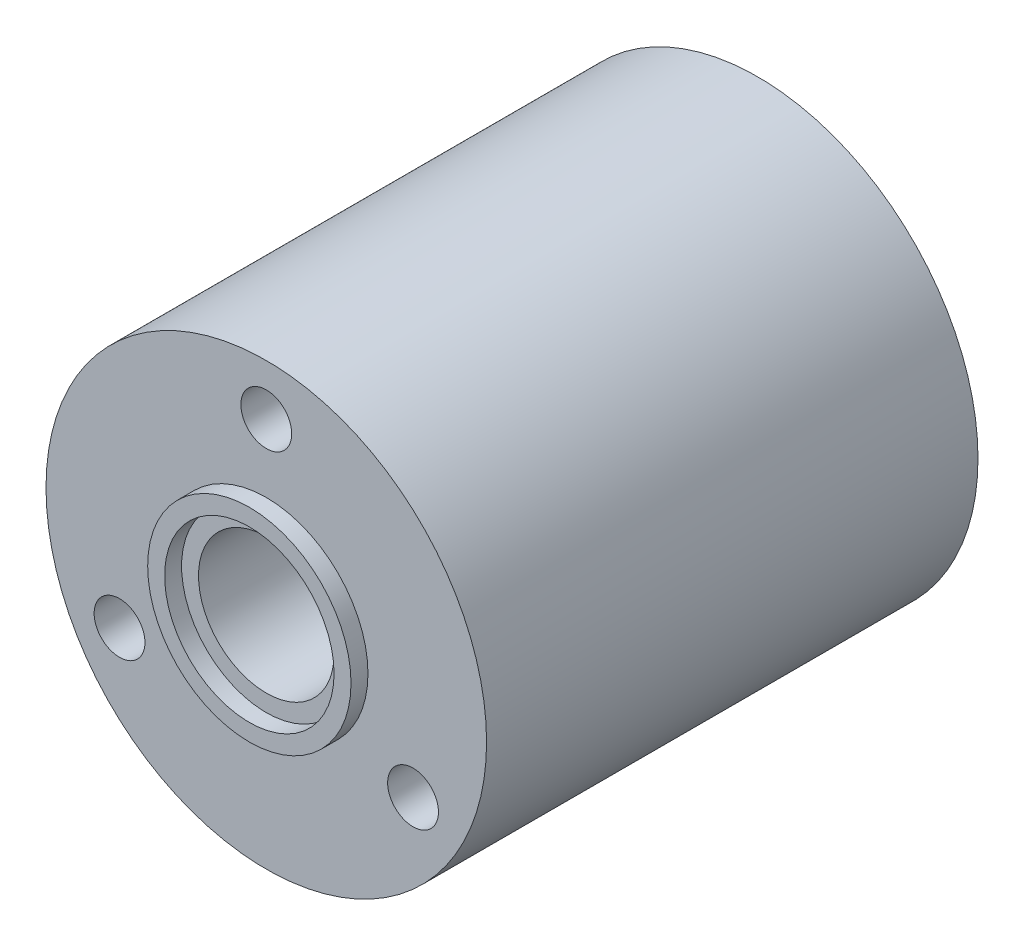
ISO-10303-21;
HEADER;
FILE_DESCRIPTION(('STEP AP214'),'2;1');
FILE_NAME('part.step','',(''),(''),'','','');
FILE_SCHEMA(('AUTOMOTIVE_DESIGN { 1 0 10303 214 1 1 1 1 }'));
ENDSEC;
DATA;
#1=APPLICATION_CONTEXT('core data for automotive mechanical design processes');
#2=APPLICATION_PROTOCOL_DEFINITION('international standard','automotive_design',2000,#1);
#3=PRODUCT_CONTEXT('',#1,'mechanical');
#4=PRODUCT('Part','Part','',(#3));
#5=PRODUCT_RELATED_PRODUCT_CATEGORY('part','',(#4));
#6=PRODUCT_DEFINITION_FORMATION('','',#4);
#7=PRODUCT_DEFINITION_CONTEXT('part definition',#1,'design');
#8=PRODUCT_DEFINITION('design','',#6,#7);
#9=PRODUCT_DEFINITION_SHAPE('','',#8);
#10=(LENGTH_UNIT() NAMED_UNIT(*) SI_UNIT(.MILLI.,.METRE.));
#11=(NAMED_UNIT(*) PLANE_ANGLE_UNIT() SI_UNIT($,.RADIAN.));
#12=(NAMED_UNIT(*) SI_UNIT($,.STERADIAN.) SOLID_ANGLE_UNIT());
#13=UNCERTAINTY_MEASURE_WITH_UNIT(LENGTH_MEASURE(1.E-05),#10,'distance_accuracy_value','');
#14=(GEOMETRIC_REPRESENTATION_CONTEXT(3) GLOBAL_UNCERTAINTY_ASSIGNED_CONTEXT((#13)) GLOBAL_UNIT_ASSIGNED_CONTEXT((#10,
#11,#12)) REPRESENTATION_CONTEXT('',''));
#15=CARTESIAN_POINT('',(0.,0.,0.));
#16=DIRECTION('',(0.,0.,1.));
#17=DIRECTION('',(1.,0.,0.));
#18=AXIS2_PLACEMENT_3D('',#15,#16,#17);
#19=CARTESIAN_POINT('',(0.,0.,29.));
#20=DIRECTION('',(0.,0.,-1.));
#21=DIRECTION('',(-1.,0.,0.));
#22=AXIS2_PLACEMENT_3D('',#19,#20,#21);
#23=CYLINDRICAL_SURFACE('',#22,5.);
#24=CARTESIAN_POINT('',(0.,0.,-1.));
#25=DIRECTION('',(0.,0.,1.));
#26=DIRECTION('',(1.,0.,0.));
#27=AXIS2_PLACEMENT_3D('',#24,#25,#26);
#28=CIRCLE('',#27,5.);
#29=CARTESIAN_POINT('',(5.,0.,-1.));
#30=VERTEX_POINT('',#29);
#31=EDGE_CURVE('E59',#30,#30,#28,.T.);
#32=ORIENTED_EDGE('',*,*,#31,.F.);
#33=EDGE_LOOP('',(#32));
#34=FACE_BOUND('',#33,.T.);
#35=CARTESIAN_POINT('',(0.,0.,0.));
#36=DIRECTION('',(0.,0.,1.));
#37=DIRECTION('',(1.,0.,0.));
#38=AXIS2_PLACEMENT_3D('',#35,#36,#37);
#39=CIRCLE('',#38,5.);
#40=CARTESIAN_POINT('',(5.,0.,0.));
#41=VERTEX_POINT('',#40);
#42=EDGE_CURVE('E72',#41,#41,#39,.T.);
#43=ORIENTED_EDGE('',*,*,#42,.T.);
#44=EDGE_LOOP('',(#43));
#45=FACE_BOUND('',#44,.T.);
#46=ADVANCED_FACE('F34',(#34,#45),#23,.F.);
#47=CARTESIAN_POINT('',(0.,0.,29.));
#48=DIRECTION('',(0.,0.,1.));
#49=DIRECTION('',(1.,0.,0.));
#50=AXIS2_PLACEMENT_3D('',#47,#48,#49);
#51=PLANE('',#50);
#52=CARTESIAN_POINT('',(-8.66025403784375,-5.00000000000037,29.));
#53=DIRECTION('',(0.,0.,1.));
#54=DIRECTION('',(1.,0.,0.));
#55=AXIS2_PLACEMENT_3D('',#52,#53,#54);
#56=CIRCLE('',#55,1.50000000000081);
#57=CARTESIAN_POINT('',(-7.16025403784294,-5.00000000000037,29.));
#58=VERTEX_POINT('',#57);
#59=EDGE_CURVE('E66',#58,#58,#56,.T.);
#60=ORIENTED_EDGE('',*,*,#59,.F.);
#61=EDGE_LOOP('',(#60));
#62=FACE_BOUND('',#61,.T.);
#63=CARTESIAN_POINT('',(8.66025403784503,-4.99999999999963,29.));
#64=DIRECTION('',(0.,0.,1.));
#65=DIRECTION('',(1.,0.,0.));
#66=AXIS2_PLACEMENT_3D('',#63,#64,#65);
#67=CIRCLE('',#66,1.50000000000055);
#68=CARTESIAN_POINT('',(10.1602540378456,-4.99999999999963,29.));
#69=VERTEX_POINT('',#68);
#70=EDGE_CURVE('E63',#69,#69,#67,.T.);
#71=ORIENTED_EDGE('',*,*,#70,.F.);
#72=EDGE_LOOP('',(#71));
#73=FACE_BOUND('',#72,.T.);
#74=CARTESIAN_POINT('',(0.,10.,29.));
#75=DIRECTION('',(0.,0.,1.));
#76=DIRECTION('',(1.,0.,0.));
#77=AXIS2_PLACEMENT_3D('',#74,#75,#76);
#78=CIRCLE('',#77,1.5);
#79=CARTESIAN_POINT('',(1.5,10.,29.));
#80=VERTEX_POINT('',#79);
#81=EDGE_CURVE('E60',#80,#80,#78,.T.);
#82=ORIENTED_EDGE('',*,*,#81,.F.);
#83=EDGE_LOOP('',(#82));
#84=FACE_BOUND('',#83,.T.);
#85=CARTESIAN_POINT('',(0.,0.,29.));
#86=DIRECTION('',(0.,0.,1.));
#87=DIRECTION('',(1.,0.,0.));
#88=AXIS2_PLACEMENT_3D('',#85,#86,#87);
#89=CIRCLE('',#88,13.);
#90=CARTESIAN_POINT('',(13.,0.,29.));
#91=VERTEX_POINT('',#90);
#92=EDGE_CURVE('E41',#91,#91,#89,.T.);
#93=ORIENTED_EDGE('',*,*,#92,.T.);
#94=EDGE_LOOP('',(#93));
#95=FACE_BOUND('',#94,.T.);
#96=CARTESIAN_POINT('',(0.,0.,29.));
#97=DIRECTION('',(0.,0.,1.));
#98=DIRECTION('',(1.,0.,0.));
#99=AXIS2_PLACEMENT_3D('',#96,#97,#98);
#100=CIRCLE('',#99,6.);
#101=CARTESIAN_POINT('',(6.,0.,29.));
#102=VERTEX_POINT('',#101);
#103=EDGE_CURVE('E53',#102,#102,#100,.T.);
#104=ORIENTED_EDGE('',*,*,#103,.F.);
#105=EDGE_LOOP('',(#104));
#106=FACE_BOUND('',#105,.T.);
#107=ADVANCED_FACE('F101',(#62,#73,#84,#95,#106),#51,.T.);
#108=CARTESIAN_POINT('',(0.,0.,0.));
#109=DIRECTION('',(0.,0.,1.));
#110=DIRECTION('',(1.,0.,0.));
#111=AXIS2_PLACEMENT_3D('',#108,#109,#110);
#112=PLANE('',#111);
#113=CARTESIAN_POINT('',(-8.66025403784375,-5.00000000000037,0.));
#114=DIRECTION('',(0.,0.,1.));
#115=DIRECTION('',(1.,0.,0.));
#116=AXIS2_PLACEMENT_3D('',#113,#114,#115);
#117=CIRCLE('',#116,1.50000000000081);
#118=CARTESIAN_POINT('',(-7.16025403784294,-5.00000000000037,0.));
#119=VERTEX_POINT('',#118);
#120=EDGE_CURVE('E64',#119,#119,#117,.T.);
#121=ORIENTED_EDGE('',*,*,#120,.T.);
#122=EDGE_LOOP('',(#121));
#123=FACE_BOUND('',#122,.T.);
#124=CARTESIAN_POINT('',(8.66025403784503,-4.99999999999963,0.));
#125=DIRECTION('',(0.,0.,1.));
#126=DIRECTION('',(1.,0.,0.));
#127=AXIS2_PLACEMENT_3D('',#124,#125,#126);
#128=CIRCLE('',#127,1.50000000000055);
#129=CARTESIAN_POINT('',(10.1602540378456,-4.99999999999963,0.));
#130=VERTEX_POINT('',#129);
#131=EDGE_CURVE('E61',#130,#130,#128,.T.);
#132=ORIENTED_EDGE('',*,*,#131,.T.);
#133=EDGE_LOOP('',(#132));
#134=FACE_BOUND('',#133,.T.);
#135=CARTESIAN_POINT('',(0.,10.,0.));
#136=DIRECTION('',(0.,0.,1.));
#137=DIRECTION('',(1.,0.,0.));
#138=AXIS2_PLACEMENT_3D('',#135,#136,#137);
#139=CIRCLE('',#138,1.5);
#140=CARTESIAN_POINT('',(1.5,10.,0.));
#141=VERTEX_POINT('',#140);
#142=EDGE_CURVE('E56',#141,#141,#139,.T.);
#143=ORIENTED_EDGE('',*,*,#142,.T.);
#144=EDGE_LOOP('',(#143));
#145=FACE_BOUND('',#144,.T.);
#146=CARTESIAN_POINT('',(0.,0.,0.));
#147=DIRECTION('',(0.,0.,1.));
#148=DIRECTION('',(1.,0.,0.));
#149=AXIS2_PLACEMENT_3D('',#146,#147,#148);
#150=CIRCLE('',#149,6.);
#151=CARTESIAN_POINT('',(6.,0.,0.));
#152=VERTEX_POINT('',#151);
#153=EDGE_CURVE('E85',#152,#152,#150,.T.);
#154=ORIENTED_EDGE('',*,*,#153,.T.);
#155=EDGE_LOOP('',(#154));
#156=FACE_BOUND('',#155,.T.);
#157=CARTESIAN_POINT('',(0.,0.,0.));
#158=DIRECTION('',(0.,0.,1.));
#159=DIRECTION('',(1.,0.,0.));
#160=AXIS2_PLACEMENT_3D('',#157,#158,#159);
#161=CIRCLE('',#160,13.);
#162=CARTESIAN_POINT('',(13.,0.,0.));
#163=VERTEX_POINT('',#162);
#164=EDGE_CURVE('E45',#163,#163,#161,.T.);
#165=ORIENTED_EDGE('',*,*,#164,.F.);
#166=EDGE_LOOP('',(#165));
#167=FACE_BOUND('',#166,.T.);
#168=ADVANCED_FACE('F103',(#123,#134,#145,#156,#167),#112,.F.);
#169=CARTESIAN_POINT('',(0.,0.,29.));
#170=DIRECTION('',(0.,0.,-1.));
#171=DIRECTION('',(-1.,0.,0.));
#172=AXIS2_PLACEMENT_3D('',#169,#170,#171);
#173=CYLINDRICAL_SURFACE('',#172,13.);
#174=ORIENTED_EDGE('',*,*,#92,.F.);
#175=EDGE_LOOP('',(#174));
#176=FACE_BOUND('',#175,.T.);
#177=ORIENTED_EDGE('',*,*,#164,.T.);
#178=EDGE_LOOP('',(#177));
#179=FACE_BOUND('',#178,.T.);
#180=ADVANCED_FACE('F36',(#176,#179),#173,.T.);
#181=CARTESIAN_POINT('',(0.,0.,29.));
#182=DIRECTION('',(0.,0.,1.));
#183=DIRECTION('',(1.,0.,0.));
#184=AXIS2_PLACEMENT_3D('',#181,#182,#183);
#185=CIRCLE('',#184,5.);
#186=CARTESIAN_POINT('',(5.,0.,29.));
#187=VERTEX_POINT('',#186);
#188=EDGE_CURVE('E10',#187,#187,#185,.T.);
#189=ORIENTED_EDGE('',*,*,#188,.F.);
#190=EDGE_LOOP('',(#189));
#191=FACE_BOUND('',#190,.T.);
#192=CARTESIAN_POINT('',(0.,0.,30.));
#193=DIRECTION('',(0.,0.,1.));
#194=DIRECTION('',(1.,0.,0.));
#195=AXIS2_PLACEMENT_3D('',#192,#193,#194);
#196=CIRCLE('',#195,5.);
#197=CARTESIAN_POINT('',(5.,0.,30.));
#198=VERTEX_POINT('',#197);
#199=EDGE_CURVE('E89',#198,#198,#196,.T.);
#200=ORIENTED_EDGE('',*,*,#199,.T.);
#201=EDGE_LOOP('',(#200));
#202=FACE_BOUND('',#201,.T.);
#203=ADVANCED_FACE('F112',(#191,#202),#23,.F.);
#204=CARTESIAN_POINT('',(0.,0.,30.));
#205=DIRECTION('',(0.,0.,1.));
#206=DIRECTION('',(1.,0.,0.));
#207=AXIS2_PLACEMENT_3D('',#204,#205,#206);
#208=PLANE('',#207);
#209=CARTESIAN_POINT('',(0.,0.,30.));
#210=DIRECTION('',(0.,0.,1.));
#211=DIRECTION('',(1.,0.,0.));
#212=AXIS2_PLACEMENT_3D('',#209,#210,#211);
#213=CIRCLE('',#212,6.);
#214=CARTESIAN_POINT('',(6.,0.,30.));
#215=VERTEX_POINT('',#214);
#216=EDGE_CURVE('E50',#215,#215,#213,.T.);
#217=ORIENTED_EDGE('',*,*,#216,.T.);
#218=EDGE_LOOP('',(#217));
#219=FACE_BOUND('',#218,.T.);
#220=ORIENTED_EDGE('',*,*,#199,.F.);
#221=EDGE_LOOP('',(#220));
#222=FACE_BOUND('',#221,.T.);
#223=ADVANCED_FACE('F116',(#219,#222),#208,.T.);
#224=CARTESIAN_POINT('',(0.,0.,30.));
#225=DIRECTION('',(0.,0.,-1.));
#226=DIRECTION('',(-1.,0.,0.));
#227=AXIS2_PLACEMENT_3D('',#224,#225,#226);
#228=CYLINDRICAL_SURFACE('',#227,6.);
#229=ORIENTED_EDGE('',*,*,#216,.F.);
#230=EDGE_LOOP('',(#229));
#231=FACE_BOUND('',#230,.T.);
#232=ORIENTED_EDGE('',*,*,#103,.T.);
#233=EDGE_LOOP('',(#232));
#234=FACE_BOUND('',#233,.T.);
#235=ADVANCED_FACE('F99',(#231,#234),#228,.T.);
#236=CARTESIAN_POINT('',(0.,0.,-1.));
#237=DIRECTION('',(0.,0.,1.));
#238=DIRECTION('',(1.,0.,0.));
#239=AXIS2_PLACEMENT_3D('',#236,#237,#238);
#240=CYLINDRICAL_SURFACE('',#239,6.);
#241=CARTESIAN_POINT('',(0.,0.,-1.));
#242=DIRECTION('',(0.,0.,1.));
#243=DIRECTION('',(1.,0.,0.));
#244=AXIS2_PLACEMENT_3D('',#241,#242,#243);
#245=CIRCLE('',#244,6.);
#246=CARTESIAN_POINT('',(6.,0.,-1.));
#247=VERTEX_POINT('',#246);
#248=EDGE_CURVE('E86',#247,#247,#245,.T.);
#249=ORIENTED_EDGE('',*,*,#248,.T.);
#250=EDGE_LOOP('',(#249));
#251=FACE_BOUND('',#250,.T.);
#252=ORIENTED_EDGE('',*,*,#153,.F.);
#253=EDGE_LOOP('',(#252));
#254=FACE_BOUND('',#253,.T.);
#255=ADVANCED_FACE('F120',(#251,#254),#240,.T.);
#256=CARTESIAN_POINT('',(0.,0.,-1.));
#257=DIRECTION('',(0.,0.,-1.));
#258=DIRECTION('',(1.,0.,0.));
#259=AXIS2_PLACEMENT_3D('',#256,#257,#258);
#260=PLANE('',#259);
#261=ORIENTED_EDGE('',*,*,#31,.T.);
#262=EDGE_LOOP('',(#261));
#263=FACE_BOUND('',#262,.T.);
#264=ORIENTED_EDGE('',*,*,#248,.F.);
#265=EDGE_LOOP('',(#264));
#266=FACE_BOUND('',#265,.T.);
#267=ADVANCED_FACE('F126',(#263,#266),#260,.T.);
#268=CARTESIAN_POINT('',(0.,10.,-1.));
#269=DIRECTION('',(0.,0.,1.));
#270=DIRECTION('',(1.,0.,0.));
#271=AXIS2_PLACEMENT_3D('',#268,#269,#270);
#272=CYLINDRICAL_SURFACE('',#271,1.5);
#273=ORIENTED_EDGE('',*,*,#81,.T.);
#274=EDGE_LOOP('',(#273));
#275=FACE_BOUND('',#274,.T.);
#276=ORIENTED_EDGE('',*,*,#142,.F.);
#277=EDGE_LOOP('',(#276));
#278=FACE_BOUND('',#277,.T.);
#279=ADVANCED_FACE('F130',(#275,#278),#272,.F.);
#280=CARTESIAN_POINT('',(8.66025403784503,-4.99999999999963,-1.));
#281=DIRECTION('',(0.,0.,1.));
#282=DIRECTION('',(1.,0.,0.));
#283=AXIS2_PLACEMENT_3D('',#280,#281,#282);
#284=CYLINDRICAL_SURFACE('',#283,1.50000000000055);
#285=ORIENTED_EDGE('',*,*,#70,.T.);
#286=EDGE_LOOP('',(#285));
#287=FACE_BOUND('',#286,.T.);
#288=ORIENTED_EDGE('',*,*,#131,.F.);
#289=EDGE_LOOP('',(#288));
#290=FACE_BOUND('',#289,.T.);
#291=ADVANCED_FACE('F134',(#287,#290),#284,.F.);
#292=CARTESIAN_POINT('',(-8.66025403784375,-5.00000000000037,-1.));
#293=DIRECTION('',(0.,0.,1.));
#294=DIRECTION('',(1.,0.,0.));
#295=AXIS2_PLACEMENT_3D('',#292,#293,#294);
#296=CYLINDRICAL_SURFACE('',#295,1.50000000000081);
#297=ORIENTED_EDGE('',*,*,#59,.T.);
#298=EDGE_LOOP('',(#297));
#299=FACE_BOUND('',#298,.T.);
#300=ORIENTED_EDGE('',*,*,#120,.F.);
#301=EDGE_LOOP('',(#300));
#302=FACE_BOUND('',#301,.T.);
#303=ADVANCED_FACE('F138',(#299,#302),#296,.F.);
#304=CARTESIAN_POINT('',(0.,0.,0.));
#305=DIRECTION('',(0.,0.,1.));
#306=DIRECTION('',(1.,0.,0.));
#307=AXIS2_PLACEMENT_3D('',#304,#305,#306);
#308=PLANE('',#307);
#309=CARTESIAN_POINT('',(0.,0.,0.));
#310=DIRECTION('',(0.,0.,1.));
#311=DIRECTION('',(1.,0.,0.));
#312=AXIS2_PLACEMENT_3D('',#309,#310,#311);
#313=CIRCLE('',#312,4.);
#314=CARTESIAN_POINT('',(4.,0.,0.));
#315=VERTEX_POINT('',#314);
#316=EDGE_CURVE('E77',#315,#315,#313,.T.);
#317=ORIENTED_EDGE('',*,*,#316,.T.);
#318=EDGE_LOOP('',(#317));
#319=FACE_BOUND('',#318,.T.);
#320=ORIENTED_EDGE('',*,*,#42,.F.);
#321=EDGE_LOOP('',(#320));
#322=FACE_BOUND('',#321,.T.);
#323=ADVANCED_FACE('F142',(#319,#322),#308,.F.);
#324=CARTESIAN_POINT('',(0.,0.,29.));
#325=DIRECTION('',(0.,0.,1.));
#326=DIRECTION('',(1.,0.,0.));
#327=AXIS2_PLACEMENT_3D('',#324,#325,#326);
#328=PLANE('',#327);
#329=CARTESIAN_POINT('',(0.,0.,29.));
#330=DIRECTION('',(0.,0.,1.));
#331=DIRECTION('',(1.,0.,0.));
#332=AXIS2_PLACEMENT_3D('',#329,#330,#331);
#333=CIRCLE('',#332,4.);
#334=CARTESIAN_POINT('',(4.,0.,29.));
#335=VERTEX_POINT('',#334);
#336=EDGE_CURVE('E160',#335,#335,#333,.T.);
#337=ORIENTED_EDGE('',*,*,#336,.F.);
#338=EDGE_LOOP('',(#337));
#339=FACE_BOUND('',#338,.T.);
#340=ORIENTED_EDGE('',*,*,#188,.T.);
#341=EDGE_LOOP('',(#340));
#342=FACE_BOUND('',#341,.T.);
#343=ADVANCED_FACE('F143',(#339,#342),#328,.T.);
#344=CARTESIAN_POINT('',(0.,0.,0.));
#345=DIRECTION('',(0.,0.,1.));
#346=DIRECTION('',(1.,0.,0.));
#347=AXIS2_PLACEMENT_3D('',#344,#345,#346);
#348=CYLINDRICAL_SURFACE('',#347,4.);
#349=ORIENTED_EDGE('',*,*,#316,.F.);
#350=EDGE_LOOP('',(#349));
#351=FACE_BOUND('',#350,.T.);
#352=ORIENTED_EDGE('',*,*,#336,.T.);
#353=EDGE_LOOP('',(#352));
#354=FACE_BOUND('',#353,.T.);
#355=ADVANCED_FACE('F146',(#351,#354),#348,.F.);
#356=CLOSED_SHELL('',(#46,#107,#168,#180,#203,#223,#235,#255,#267,#279,#291,#303,#323,#343,#355));
#357=MANIFOLD_SOLID_BREP('B2',#356);
#358=ADVANCED_BREP_SHAPE_REPRESENTATION('',(#18,#357),#14);
#359=SHAPE_DEFINITION_REPRESENTATION(#9,#358);
ENDSEC;
END-ISO-10303-21;
